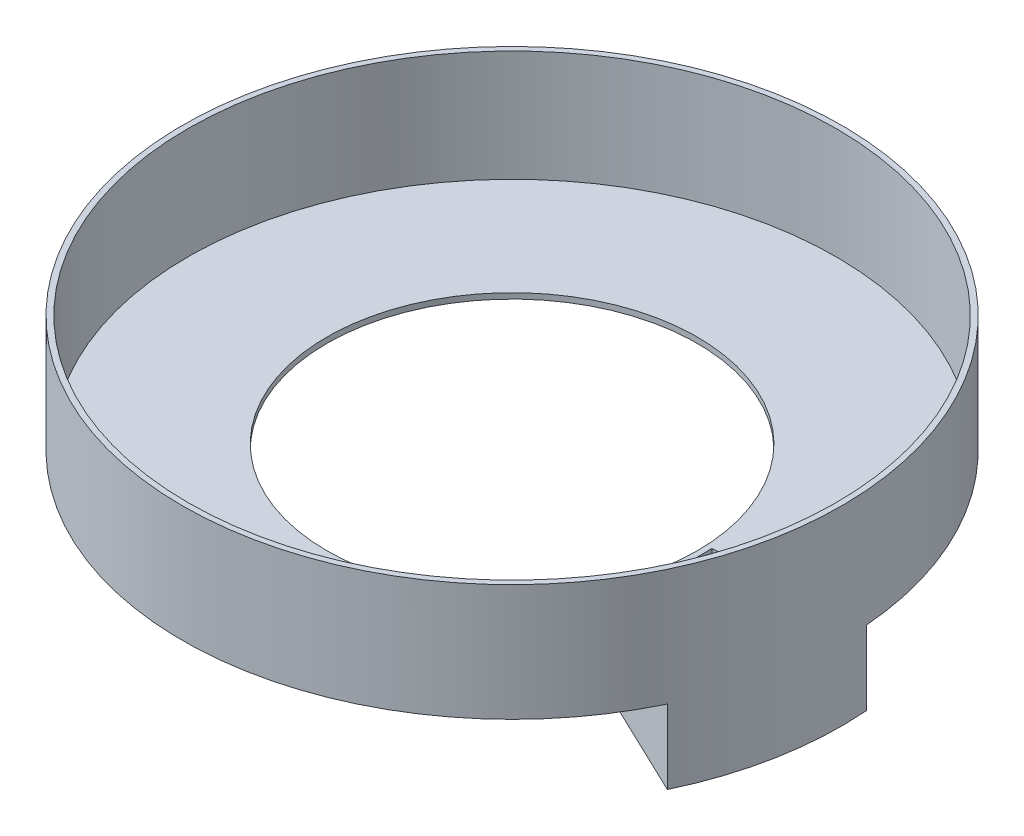
ISO-10303-21;
HEADER;
FILE_DESCRIPTION(('STEP AP214'),'2;1');
FILE_NAME('part.step','',(''),(''),'','','');
FILE_SCHEMA(('AUTOMOTIVE_DESIGN { 1 0 10303 214 1 1 1 1 }'));
ENDSEC;
DATA;
#1=APPLICATION_CONTEXT('core data for automotive mechanical design processes');
#2=APPLICATION_PROTOCOL_DEFINITION('international standard','automotive_design',2000,#1);
#3=PRODUCT_CONTEXT('',#1,'mechanical');
#4=PRODUCT('Part','Part','',(#3));
#5=PRODUCT_RELATED_PRODUCT_CATEGORY('part','',(#4));
#6=PRODUCT_DEFINITION_FORMATION('','',#4);
#7=PRODUCT_DEFINITION_CONTEXT('part definition',#1,'design');
#8=PRODUCT_DEFINITION('design','',#6,#7);
#9=PRODUCT_DEFINITION_SHAPE('','',#8);
#10=(LENGTH_UNIT() NAMED_UNIT(*) SI_UNIT(.MILLI.,.METRE.));
#11=(NAMED_UNIT(*) PLANE_ANGLE_UNIT() SI_UNIT($,.RADIAN.));
#12=(NAMED_UNIT(*) SI_UNIT($,.STERADIAN.) SOLID_ANGLE_UNIT());
#13=UNCERTAINTY_MEASURE_WITH_UNIT(LENGTH_MEASURE(1.E-05),#10,'distance_accuracy_value','');
#14=(GEOMETRIC_REPRESENTATION_CONTEXT(3) GLOBAL_UNCERTAINTY_ASSIGNED_CONTEXT((#13)) GLOBAL_UNIT_ASSIGNED_CONTEXT((#10,
#11,#12)) REPRESENTATION_CONTEXT('',''));
#15=CARTESIAN_POINT('',(0.,0.,0.));
#16=DIRECTION('',(0.,0.,1.));
#17=DIRECTION('',(1.,0.,0.));
#18=AXIS2_PLACEMENT_3D('',#15,#16,#17);
#19=CARTESIAN_POINT('',(0.,3.,0.));
#20=DIRECTION('',(0.,1.,0.));
#21=DIRECTION('',(0.,0.,1.));
#22=AXIS2_PLACEMENT_3D('',#19,#20,#21);
#23=PLANE('',#22);
#24=DIRECTION('',(0.996976205475113,0.,-0.0777074366868777));
#25=VECTOR('',#24,1.);
#26=CARTESIAN_POINT('',(102.878105019425,3.,-5.00954165689724));
#27=LINE('',#26,#25);
#28=CARTESIAN_POINT('',(102.878105019425,3.,-5.00954165689723));
#29=VERTEX_POINT('',#28);
#30=CARTESIAN_POINT('',(174.67831985343,3.,-10.6058744657217));
#31=VERTEX_POINT('',#30);
#32=EDGE_CURVE('E115',#29,#31,#27,.T.);
#33=ORIENTED_EDGE('',*,*,#32,.T.);
#34=CARTESIAN_POINT('',(0.,3.,0.));
#35=DIRECTION('',(0.,1.,0.));
#36=DIRECTION('',(0.,0.,1.));
#37=AXIS2_PLACEMENT_3D('',#34,#35,#36);
#38=CIRCLE('',#37,175.);
#39=CARTESIAN_POINT('',(159.165948647338,3.,72.7406405745307));
#40=VERTEX_POINT('',#39);
#41=EDGE_CURVE('E11',#40,#31,#38,.F.);
#42=ORIENTED_EDGE('',*,*,#41,.F.);
#43=DIRECTION('',(-0.902260439253501,0.,-0.431191488503751));
#44=VECTOR('',#43,1.);
#45=CARTESIAN_POINT('',(159.165948647338,3.,72.7406405745307));
#46=LINE('',#45,#44);
#47=CARTESIAN_POINT('',(94.1869721994964,3.,41.6870995380022));
#48=VERTEX_POINT('',#47);
#49=EDGE_CURVE('E112',#40,#48,#46,.T.);
#50=ORIENTED_EDGE('',*,*,#49,.T.);
#51=CARTESIAN_POINT('',(0.,3.,0.));
#52=DIRECTION('',(0.,1.,0.));
#53=DIRECTION('',(0.,0.,1.));
#54=AXIS2_PLACEMENT_3D('',#51,#52,#53);
#55=CIRCLE('',#54,103.);
#56=EDGE_CURVE('E147',#48,#29,#55,.T.);
#57=ORIENTED_EDGE('',*,*,#56,.T.);
#58=EDGE_LOOP('',(#33,#42,#50,#57));
#59=FACE_BOUND('',#58,.T.);
#60=CARTESIAN_POINT('',(0.,3.,0.));
#61=DIRECTION('',(0.,1.,0.));
#62=DIRECTION('',(0.,0.,1.));
#63=AXIS2_PLACEMENT_3D('',#60,#61,#62);
#64=CIRCLE('',#63,100.);
#65=CARTESIAN_POINT('',(0.,3.,100.));
#66=VERTEX_POINT('',#65);
#67=EDGE_CURVE('E173',#66,#66,#64,.T.);
#68=ORIENTED_EDGE('',*,*,#67,.F.);
#69=EDGE_LOOP('',(#68));
#70=FACE_BOUND('',#69,.T.);
#71=ADVANCED_FACE('F38',(#59,#70),#23,.T.);
#72=CARTESIAN_POINT('',(0.,0.,0.));
#73=DIRECTION('',(0.,1.,0.));
#74=DIRECTION('',(0.,0.,1.));
#75=AXIS2_PLACEMENT_3D('',#72,#73,#74);
#76=PLANE('',#75);
#77=DIRECTION('',(0.902260439253501,0.,0.431191488503751));
#78=VECTOR('',#77,1.);
#79=CARTESIAN_POINT('',(0.,0.,0.));
#80=LINE('',#79,#78);
#81=CARTESIAN_POINT('',(90.2260439253501,0.,43.1191488503751));
#82=VERTEX_POINT('',#81);
#83=CARTESIAN_POINT('',(160.602358187123,0.,76.7520849536676));
#84=VERTEX_POINT('',#83);
#85=EDGE_CURVE('E60',#82,#84,#80,.T.);
#86=ORIENTED_EDGE('',*,*,#85,.T.);
#87=CARTESIAN_POINT('',(0.,0.,0.));
#88=DIRECTION('',(0.,1.,0.));
#89=DIRECTION('',(0.,0.,1.));
#90=AXIS2_PLACEMENT_3D('',#87,#88,#89);
#91=CIRCLE('',#90,178.);
#92=CARTESIAN_POINT('',(177.46176457457,0.,-13.8319237302642));
#93=VERTEX_POINT('',#92);
#94=EDGE_CURVE('E46',#93,#84,#91,.T.);
#95=ORIENTED_EDGE('',*,*,#94,.F.);
#96=DIRECTION('',(0.996976205475113,0.,-0.0777074366868777));
#97=VECTOR('',#96,1.);
#98=CARTESIAN_POINT('',(0.,0.,0.));
#99=LINE('',#98,#97);
#100=CARTESIAN_POINT('',(99.6976205475113,0.,-7.77074366868777));
#101=VERTEX_POINT('',#100);
#102=EDGE_CURVE('E53',#101,#93,#99,.T.);
#103=ORIENTED_EDGE('',*,*,#102,.F.);
#104=CARTESIAN_POINT('',(0.,0.,0.));
#105=DIRECTION('',(0.,1.,0.));
#106=DIRECTION('',(0.,0.,1.));
#107=AXIS2_PLACEMENT_3D('',#104,#105,#106);
#108=CIRCLE('',#107,100.);
#109=EDGE_CURVE('E172',#101,#82,#108,.T.);
#110=ORIENTED_EDGE('',*,*,#109,.T.);
#111=EDGE_LOOP('',(#86,#95,#103,#110));
#112=FACE_BOUND('',#111,.T.);
#113=ADVANCED_FACE('F205',(#112),#76,.F.);
#114=CARTESIAN_POINT('',(0.,3.,0.));
#115=DIRECTION('',(0.,-1.,0.));
#116=DIRECTION('',(0.,0.,-1.));
#117=AXIS2_PLACEMENT_3D('',#114,#115,#116);
#118=CYLINDRICAL_SURFACE('',#117,100.);
#119=ORIENTED_EDGE('',*,*,#67,.T.);
#120=EDGE_LOOP('',(#119));
#121=FACE_BOUND('',#120,.T.);
#122=ORIENTED_EDGE('',*,*,#109,.F.);
#123=DIRECTION('',(0.,-1.,0.));
#124=VECTOR('',#123,1.);
#125=CARTESIAN_POINT('',(99.6976205475113,3.,-7.77074366868777));
#126=LINE('',#125,#124);
#127=CARTESIAN_POINT('',(99.6976205475113,-40.,-7.77074366868777));
#128=VERTEX_POINT('',#127);
#129=EDGE_CURVE('E153',#101,#128,#126,.T.);
#130=ORIENTED_EDGE('',*,*,#129,.T.);
#131=CARTESIAN_POINT('',(0.,-40.,0.));
#132=DIRECTION('',(0.,1.,0.));
#133=DIRECTION('',(0.,0.,1.));
#134=AXIS2_PLACEMENT_3D('',#131,#132,#133);
#135=CIRCLE('',#134,100.);
#136=CARTESIAN_POINT('',(90.2260439253501,-40.,43.1191488503751));
#137=VERTEX_POINT('',#136);
#138=EDGE_CURVE('E134',#137,#128,#135,.T.);
#139=ORIENTED_EDGE('',*,*,#138,.F.);
#140=DIRECTION('',(0.,-1.,0.));
#141=VECTOR('',#140,1.);
#142=CARTESIAN_POINT('',(90.2260439253501,3.,43.1191488503751));
#143=LINE('',#142,#141);
#144=EDGE_CURVE('E157',#82,#137,#143,.T.);
#145=ORIENTED_EDGE('',*,*,#144,.F.);
#146=EDGE_LOOP('',(#122,#130,#139,#145));
#147=FACE_BOUND('',#146,.T.);
#148=ADVANCED_FACE('F189',(#121,#147),#118,.F.);
#149=CARTESIAN_POINT('',(0.,3.,0.));
#150=DIRECTION('',(0.,-1.,0.));
#151=DIRECTION('',(0.,0.,-1.));
#152=AXIS2_PLACEMENT_3D('',#149,#150,#151);
#153=CYLINDRICAL_SURFACE('',#152,178.);
#154=ORIENTED_EDGE('',*,*,#94,.T.);
#155=DIRECTION('',(0.,-1.,0.));
#156=VECTOR('',#155,1.);
#157=CARTESIAN_POINT('',(160.602358187123,3.,76.7520849536676));
#158=LINE('',#157,#156);
#159=CARTESIAN_POINT('',(160.602358187123,-40.,76.7520849536676));
#160=VERTEX_POINT('',#159);
#161=EDGE_CURVE('E159',#84,#160,#158,.T.);
#162=ORIENTED_EDGE('',*,*,#161,.T.);
#163=CARTESIAN_POINT('',(0.,-40.,0.));
#164=DIRECTION('',(0.,-1.,0.));
#165=DIRECTION('',(0.,0.,1.));
#166=AXIS2_PLACEMENT_3D('',#163,#164,#165);
#167=CIRCLE('',#166,178.);
#168=CARTESIAN_POINT('',(177.46176457457,-40.,-13.8319237302642));
#169=VERTEX_POINT('',#168);
#170=EDGE_CURVE('E140',#169,#160,#167,.T.);
#171=ORIENTED_EDGE('',*,*,#170,.F.);
#172=DIRECTION('',(0.,-1.,0.));
#173=VECTOR('',#172,1.);
#174=CARTESIAN_POINT('',(177.46176457457,3.,-13.8319237302642));
#175=LINE('',#174,#173);
#176=EDGE_CURVE('E161',#93,#169,#175,.T.);
#177=ORIENTED_EDGE('',*,*,#176,.F.);
#178=EDGE_LOOP('',(#154,#162,#171,#177));
#179=FACE_BOUND('',#178,.T.);
#180=CARTESIAN_POINT('',(0.,63.,0.));
#181=DIRECTION('',(0.,1.,0.));
#182=DIRECTION('',(0.,0.,1.));
#183=AXIS2_PLACEMENT_3D('',#180,#181,#182);
#184=CIRCLE('',#183,178.);
#185=CARTESIAN_POINT('',(0.,63.,178.));
#186=VERTEX_POINT('',#185);
#187=EDGE_CURVE('E169',#186,#186,#184,.T.);
#188=ORIENTED_EDGE('',*,*,#187,.F.);
#189=EDGE_LOOP('',(#188));
#190=FACE_BOUND('',#189,.T.);
#191=ADVANCED_FACE('F40',(#179,#190),#153,.T.);
#192=CARTESIAN_POINT('',(0.,63.,0.));
#193=DIRECTION('',(0.,1.,0.));
#194=DIRECTION('',(0.,0.,1.));
#195=AXIS2_PLACEMENT_3D('',#192,#193,#194);
#196=PLANE('',#195);
#197=ORIENTED_EDGE('',*,*,#187,.T.);
#198=EDGE_LOOP('',(#197));
#199=FACE_BOUND('',#198,.T.);
#200=CARTESIAN_POINT('',(0.,63.,0.));
#201=DIRECTION('',(0.,1.,0.));
#202=DIRECTION('',(0.,0.,1.));
#203=AXIS2_PLACEMENT_3D('',#200,#201,#202);
#204=CIRCLE('',#203,175.);
#205=CARTESIAN_POINT('',(0.,63.,175.));
#206=VERTEX_POINT('',#205);
#207=EDGE_CURVE('E166',#206,#206,#204,.T.);
#208=ORIENTED_EDGE('',*,*,#207,.F.);
#209=EDGE_LOOP('',(#208));
#210=FACE_BOUND('',#209,.T.);
#211=ADVANCED_FACE('F216',(#199,#210),#196,.T.);
#212=CARTESIAN_POINT('',(0.,63.,0.));
#213=DIRECTION('',(0.,-1.,0.));
#214=DIRECTION('',(0.,0.,-1.));
#215=AXIS2_PLACEMENT_3D('',#212,#213,#214);
#216=CYLINDRICAL_SURFACE('',#215,175.);
#217=DIRECTION('',(0.,-1.,0.));
#218=VECTOR('',#217,1.);
#219=CARTESIAN_POINT('',(159.165948647338,3.,72.7406405745307));
#220=LINE('',#219,#218);
#221=CARTESIAN_POINT('',(159.165948647338,-40.,72.7406405745307));
#222=VERTEX_POINT('',#221);
#223=EDGE_CURVE('E104',#40,#222,#220,.T.);
#224=ORIENTED_EDGE('',*,*,#223,.F.);
#225=ORIENTED_EDGE('',*,*,#41,.T.);
#226=DIRECTION('',(0.,-1.,0.));
#227=VECTOR('',#226,1.);
#228=CARTESIAN_POINT('',(174.67831985343,3.,-10.6058744657217));
#229=LINE('',#228,#227);
#230=CARTESIAN_POINT('',(174.67831985343,-40.,-10.6058744657217));
#231=VERTEX_POINT('',#230);
#232=EDGE_CURVE('E121',#31,#231,#229,.T.);
#233=ORIENTED_EDGE('',*,*,#232,.T.);
#234=CARTESIAN_POINT('',(0.,-40.,0.));
#235=DIRECTION('',(0.,-1.,0.));
#236=DIRECTION('',(0.,0.,1.));
#237=AXIS2_PLACEMENT_3D('',#234,#235,#236);
#238=CIRCLE('',#237,175.);
#239=EDGE_CURVE('E118',#231,#222,#238,.T.);
#240=ORIENTED_EDGE('',*,*,#239,.T.);
#241=EDGE_LOOP('',(#224,#225,#233,#240));
#242=FACE_BOUND('',#241,.T.);
#243=ORIENTED_EDGE('',*,*,#207,.T.);
#244=EDGE_LOOP('',(#243));
#245=FACE_BOUND('',#244,.T.);
#246=ADVANCED_FACE('F119',(#242,#245),#216,.F.);
#247=CARTESIAN_POINT('',(160.602358187123,3.,76.7520849536676));
#248=DIRECTION('',(-0.43119148850375,0.,0.902260439253501));
#249=DIRECTION('',(0.902260439253501,0.,0.43119148850375));
#250=AXIS2_PLACEMENT_3D('',#247,#248,#249);
#251=PLANE('',#250);
#252=ORIENTED_EDGE('',*,*,#85,.F.);
#253=ORIENTED_EDGE('',*,*,#144,.T.);
#254=DIRECTION('',(-0.902260439253501,0.,-0.431191488503751));
#255=VECTOR('',#254,1.);
#256=CARTESIAN_POINT('',(160.602358187123,-40.,76.7520849536676));
#257=LINE('',#256,#255);
#258=EDGE_CURVE('E143',#160,#137,#257,.T.);
#259=ORIENTED_EDGE('',*,*,#258,.F.);
#260=ORIENTED_EDGE('',*,*,#161,.F.);
#261=EDGE_LOOP('',(#252,#253,#259,#260));
#262=FACE_BOUND('',#261,.T.);
#263=ADVANCED_FACE('F183',(#262),#251,.T.);
#264=CARTESIAN_POINT('',(99.6976205475113,3.,-7.77074366868777));
#265=DIRECTION('',(-0.0777074366868778,0.,-0.996976205475113));
#266=DIRECTION('',(-0.996976205475113,0.,0.0777074366868778));
#267=AXIS2_PLACEMENT_3D('',#264,#265,#266);
#268=PLANE('',#267);
#269=ORIENTED_EDGE('',*,*,#102,.T.);
#270=ORIENTED_EDGE('',*,*,#176,.T.);
#271=DIRECTION('',(0.996976205475113,0.,-0.0777074366868777));
#272=VECTOR('',#271,1.);
#273=CARTESIAN_POINT('',(99.6976205475113,-40.,-7.77074366868777));
#274=LINE('',#273,#272);
#275=EDGE_CURVE('E137',#128,#169,#274,.T.);
#276=ORIENTED_EDGE('',*,*,#275,.F.);
#277=ORIENTED_EDGE('',*,*,#129,.F.);
#278=EDGE_LOOP('',(#269,#270,#276,#277));
#279=FACE_BOUND('',#278,.T.);
#280=ADVANCED_FACE('F191',(#279),#268,.T.);
#281=CARTESIAN_POINT('',(102.878105019425,3.,-5.00954165689724));
#282=DIRECTION('',(-0.0777074366868777,0.,-0.996976205475113));
#283=DIRECTION('',(-0.996976205475113,0.,0.0777074366868777));
#284=AXIS2_PLACEMENT_3D('',#281,#282,#283);
#285=PLANE('',#284);
#286=DIRECTION('',(0.,-1.,0.));
#287=VECTOR('',#286,1.);
#288=CARTESIAN_POINT('',(102.878105019425,3.,-5.00954165689723));
#289=LINE('',#288,#287);
#290=CARTESIAN_POINT('',(102.878105019425,-40.,-5.00954165689724));
#291=VERTEX_POINT('',#290);
#292=EDGE_CURVE('E154',#29,#291,#289,.T.);
#293=ORIENTED_EDGE('',*,*,#292,.T.);
#294=DIRECTION('',(0.996976205475113,0.,-0.0777074366868777));
#295=VECTOR('',#294,1.);
#296=CARTESIAN_POINT('',(102.878105019425,-40.,-5.00954165689724));
#297=LINE('',#296,#295);
#298=EDGE_CURVE('E130',#291,#231,#297,.T.);
#299=ORIENTED_EDGE('',*,*,#298,.T.);
#300=ORIENTED_EDGE('',*,*,#232,.F.);
#301=ORIENTED_EDGE('',*,*,#32,.F.);
#302=EDGE_LOOP('',(#293,#299,#300,#301));
#303=FACE_BOUND('',#302,.T.);
#304=ADVANCED_FACE('F193',(#303),#285,.F.);
#305=CARTESIAN_POINT('',(0.,3.,0.));
#306=DIRECTION('',(0.,-1.,0.));
#307=DIRECTION('',(0.,0.,-1.));
#308=AXIS2_PLACEMENT_3D('',#305,#306,#307);
#309=CYLINDRICAL_SURFACE('',#308,103.);
#310=DIRECTION('',(0.,-1.,0.));
#311=VECTOR('',#310,1.);
#312=CARTESIAN_POINT('',(94.1869721994964,3.,41.6870995380022));
#313=LINE('',#312,#311);
#314=CARTESIAN_POINT('',(94.1869721994964,-40.,41.6870995380022));
#315=VERTEX_POINT('',#314);
#316=EDGE_CURVE('E114',#48,#315,#313,.T.);
#317=ORIENTED_EDGE('',*,*,#316,.T.);
#318=CARTESIAN_POINT('',(0.,-40.,0.));
#319=DIRECTION('',(0.,1.,0.));
#320=DIRECTION('',(0.,0.,1.));
#321=AXIS2_PLACEMENT_3D('',#318,#319,#320);
#322=CIRCLE('',#321,103.);
#323=EDGE_CURVE('E128',#315,#291,#322,.T.);
#324=ORIENTED_EDGE('',*,*,#323,.T.);
#325=ORIENTED_EDGE('',*,*,#292,.F.);
#326=ORIENTED_EDGE('',*,*,#56,.F.);
#327=EDGE_LOOP('',(#317,#324,#325,#326));
#328=FACE_BOUND('',#327,.T.);
#329=ADVANCED_FACE('F199',(#328),#309,.T.);
#330=CARTESIAN_POINT('',(159.165948647338,3.,72.7406405745307));
#331=DIRECTION('',(-0.431191488503751,0.,0.902260439253501));
#332=DIRECTION('',(0.902260439253501,0.,0.431191488503751));
#333=AXIS2_PLACEMENT_3D('',#330,#331,#332);
#334=PLANE('',#333);
#335=ORIENTED_EDGE('',*,*,#223,.T.);
#336=DIRECTION('',(-0.902260439253501,0.,-0.431191488503751));
#337=VECTOR('',#336,1.);
#338=CARTESIAN_POINT('',(159.165948647338,-40.,72.7406405745307));
#339=LINE('',#338,#337);
#340=EDGE_CURVE('E109',#222,#315,#339,.T.);
#341=ORIENTED_EDGE('',*,*,#340,.T.);
#342=ORIENTED_EDGE('',*,*,#316,.F.);
#343=ORIENTED_EDGE('',*,*,#49,.F.);
#344=EDGE_LOOP('',(#335,#341,#342,#343));
#345=FACE_BOUND('',#344,.T.);
#346=ADVANCED_FACE('F106',(#345),#334,.F.);
#347=CARTESIAN_POINT('',(0.,-40.,0.));
#348=DIRECTION('',(0.,1.,0.));
#349=DIRECTION('',(0.,0.,1.));
#350=AXIS2_PLACEMENT_3D('',#347,#348,#349);
#351=PLANE('',#350);
#352=ORIENTED_EDGE('',*,*,#138,.T.);
#353=ORIENTED_EDGE('',*,*,#275,.T.);
#354=ORIENTED_EDGE('',*,*,#170,.T.);
#355=ORIENTED_EDGE('',*,*,#258,.T.);
#356=EDGE_LOOP('',(#352,#353,#354,#355));
#357=FACE_BOUND('',#356,.T.);
#358=ORIENTED_EDGE('',*,*,#239,.F.);
#359=ORIENTED_EDGE('',*,*,#298,.F.);
#360=ORIENTED_EDGE('',*,*,#323,.F.);
#361=ORIENTED_EDGE('',*,*,#340,.F.);
#362=EDGE_LOOP('',(#358,#359,#360,#361));
#363=FACE_BOUND('',#362,.T.);
#364=ADVANCED_FACE('F126',(#357,#363),#351,.F.);
#365=CLOSED_SHELL('',(#71,#113,#148,#191,#211,#246,#263,#280,#304,#329,#346,#364));
#366=MANIFOLD_SOLID_BREP('B2',#365);
#367=ADVANCED_BREP_SHAPE_REPRESENTATION('',(#18,#366),#14);
#368=SHAPE_DEFINITION_REPRESENTATION(#9,#367);
ENDSEC;
END-ISO-10303-21;
